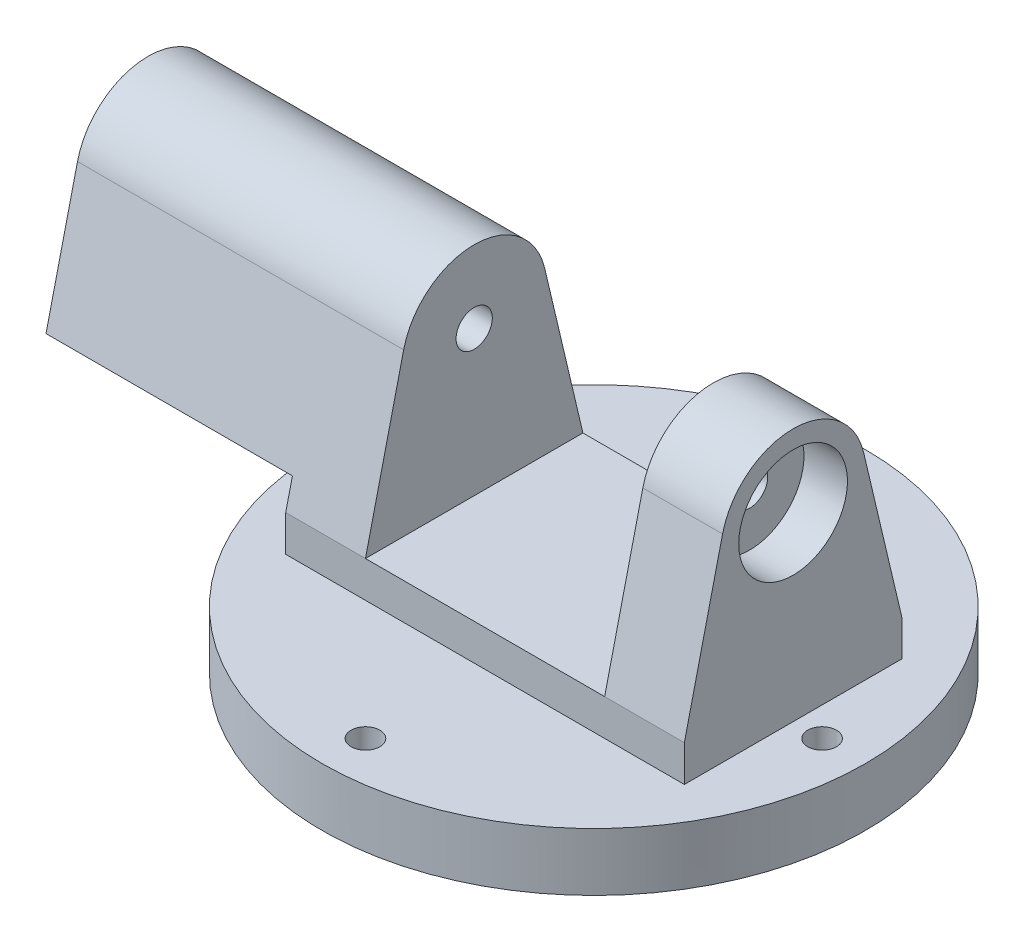
ISO-10303-21;
HEADER;
FILE_DESCRIPTION(('STEP AP214'),'2;1');
FILE_NAME('part.step','',(''),(''),'','','');
FILE_SCHEMA(('AUTOMOTIVE_DESIGN { 1 0 10303 214 1 1 1 1 }'));
ENDSEC;
DATA;
#1=APPLICATION_CONTEXT('core data for automotive mechanical design processes');
#2=APPLICATION_PROTOCOL_DEFINITION('international standard','automotive_design',2000,#1);
#3=PRODUCT_CONTEXT('',#1,'mechanical');
#4=PRODUCT('Part','Part','',(#3));
#5=PRODUCT_RELATED_PRODUCT_CATEGORY('part','',(#4));
#6=PRODUCT_DEFINITION_FORMATION('','',#4);
#7=PRODUCT_DEFINITION_CONTEXT('part definition',#1,'design');
#8=PRODUCT_DEFINITION('design','',#6,#7);
#9=PRODUCT_DEFINITION_SHAPE('','',#8);
#10=(LENGTH_UNIT() NAMED_UNIT(*) SI_UNIT(.MILLI.,.METRE.));
#11=(NAMED_UNIT(*) PLANE_ANGLE_UNIT() SI_UNIT($,.RADIAN.));
#12=(NAMED_UNIT(*) SI_UNIT($,.STERADIAN.) SOLID_ANGLE_UNIT());
#13=UNCERTAINTY_MEASURE_WITH_UNIT(LENGTH_MEASURE(1.E-05),#10,'distance_accuracy_value','');
#14=(GEOMETRIC_REPRESENTATION_CONTEXT(3) GLOBAL_UNCERTAINTY_ASSIGNED_CONTEXT((#13)) GLOBAL_UNIT_ASSIGNED_CONTEXT((#10,
#11,#12)) REPRESENTATION_CONTEXT('',''));
#15=CARTESIAN_POINT('',(0.,0.,0.));
#16=DIRECTION('',(0.,0.,1.));
#17=DIRECTION('',(1.,0.,0.));
#18=AXIS2_PLACEMENT_3D('',#15,#16,#17);
#19=CARTESIAN_POINT('',(-55.,18.,0.));
#20=DIRECTION('',(1.,0.,0.));
#21=DIRECTION('',(0.,0.,-1.));
#22=AXIS2_PLACEMENT_3D('',#19,#20,#21);
#23=PLANE('',#22);
#24=DIRECTION('',(0.,0.,1.));
#25=VECTOR('',#24,1.);
#26=CARTESIAN_POINT('',(-55.,25.8246682424095,-28.15152747619));
#27=LINE('',#26,#25);
#28=CARTESIAN_POINT('',(-55.,25.8246682424095,-28.15152747619));
#29=VERTEX_POINT('',#28);
#30=CARTESIAN_POINT('',(-55.,25.8246682424095,28.15152747619));
#31=VERTEX_POINT('',#30);
#32=EDGE_CURVE('E159',#29,#31,#27,.T.);
#33=ORIENTED_EDGE('',*,*,#32,.F.);
#34=DIRECTION('',(0.,0.973212295808088,0.229908301911762));
#35=VECTOR('',#34,1.);
#36=CARTESIAN_POINT('',(-55.,18.,-30.));
#37=LINE('',#36,#35);
#38=CARTESIAN_POINT('',(-55.,18.,-30.));
#39=VERTEX_POINT('',#38);
#40=EDGE_CURVE('E191',#39,#29,#37,.T.);
#41=ORIENTED_EDGE('',*,*,#40,.F.);
#42=DIRECTION('',(0.,-1.,0.));
#43=VECTOR('',#42,1.);
#44=CARTESIAN_POINT('',(-55.,18.,-30.));
#45=LINE('',#44,#43);
#46=CARTESIAN_POINT('',(-55.,8.,-30.));
#47=VERTEX_POINT('',#46);
#48=EDGE_CURVE('E240',#39,#47,#45,.T.);
#49=ORIENTED_EDGE('',*,*,#48,.T.);
#50=DIRECTION('',(0.,0.,1.));
#51=VECTOR('',#50,1.);
#52=CARTESIAN_POINT('',(-55.,8.,0.));
#53=LINE('',#52,#51);
#54=CARTESIAN_POINT('',(-55.,8.,30.));
#55=VERTEX_POINT('',#54);
#56=EDGE_CURVE('E247',#47,#55,#53,.T.);
#57=ORIENTED_EDGE('',*,*,#56,.T.);
#58=DIRECTION('',(0.,-1.,0.));
#59=VECTOR('',#58,1.);
#60=CARTESIAN_POINT('',(-55.,18.,30.));
#61=LINE('',#60,#59);
#62=CARTESIAN_POINT('',(-55.,18.,30.));
#63=VERTEX_POINT('',#62);
#64=EDGE_CURVE('E256',#63,#55,#61,.T.);
#65=ORIENTED_EDGE('',*,*,#64,.F.);
#66=DIRECTION('',(0.,-0.973212295808088,0.229908301911763));
#67=VECTOR('',#66,1.);
#68=CARTESIAN_POINT('',(-55.,18.,30.));
#69=LINE('',#68,#67);
#70=EDGE_CURVE('E194',#31,#63,#69,.T.);
#71=ORIENTED_EDGE('',*,*,#70,.F.);
#72=EDGE_LOOP('',(#33,#41,#49,#57,#65,#71));
#73=FACE_BOUND('',#72,.T.);
#74=ADVANCED_FACE('F42',(#73),#23,.F.);
#75=CARTESIAN_POINT('',(0.,18.,0.));
#76=DIRECTION('',(0.,-1.,0.));
#77=DIRECTION('',(0.,0.,-1.));
#78=AXIS2_PLACEMENT_3D('',#75,#76,#77);
#79=PLANE('',#78);
#80=DIRECTION('',(0.,0.,-1.));
#81=VECTOR('',#80,1.);
#82=CARTESIAN_POINT('',(-33.,18.,30.));
#83=LINE('',#82,#81);
#84=CARTESIAN_POINT('',(-33.,18.,30.));
#85=VERTEX_POINT('',#84);
#86=CARTESIAN_POINT('',(-33.,18.,-30.));
#87=VERTEX_POINT('',#86);
#88=EDGE_CURVE('E64',#85,#87,#83,.T.);
#89=ORIENTED_EDGE('',*,*,#88,.F.);
#90=DIRECTION('',(1.,0.,0.));
#91=VECTOR('',#90,1.);
#92=CARTESIAN_POINT('',(55.,18.,30.));
#93=LINE('',#92,#91);
#94=CARTESIAN_POINT('',(33.,18.,30.));
#95=VERTEX_POINT('',#94);
#96=EDGE_CURVE('E236',#85,#95,#93,.T.);
#97=ORIENTED_EDGE('',*,*,#96,.T.);
#98=DIRECTION('',(0.,0.,-1.));
#99=VECTOR('',#98,1.);
#100=CARTESIAN_POINT('',(33.,18.,30.));
#101=LINE('',#100,#99);
#102=CARTESIAN_POINT('',(33.,18.,-30.));
#103=VERTEX_POINT('',#102);
#104=EDGE_CURVE('E212',#95,#103,#101,.T.);
#105=ORIENTED_EDGE('',*,*,#104,.T.);
#106=DIRECTION('',(-1.,0.,0.));
#107=VECTOR('',#106,1.);
#108=CARTESIAN_POINT('',(-55.,18.,-30.));
#109=LINE('',#108,#107);
#110=EDGE_CURVE('E235',#103,#87,#109,.T.);
#111=ORIENTED_EDGE('',*,*,#110,.T.);
#112=EDGE_LOOP('',(#89,#97,#105,#111));
#113=FACE_BOUND('',#112,.T.);
#114=ADVANCED_FACE('F347',(#113),#79,.F.);
#115=CARTESIAN_POINT('',(0.,8.,0.));
#116=DIRECTION('',(0.,1.,0.));
#117=DIRECTION('',(0.,0.,1.));
#118=AXIS2_PLACEMENT_3D('',#115,#116,#117);
#119=PLANE('',#118);
#120=CARTESIAN_POINT('',(0.,8.,-63.));
#121=DIRECTION('',(0.,1.,0.));
#122=DIRECTION('',(0.,0.,1.));
#123=AXIS2_PLACEMENT_3D('',#120,#121,#122);
#124=CIRCLE('',#123,3.97);
#125=CARTESIAN_POINT('',(0.,8.,-59.03));
#126=VERTEX_POINT('',#125);
#127=EDGE_CURVE('E260',#126,#126,#124,.T.);
#128=ORIENTED_EDGE('',*,*,#127,.F.);
#129=EDGE_LOOP('',(#128));
#130=FACE_BOUND('',#129,.T.);
#131=CARTESIAN_POINT('',(63.,8.,2.21432900506094E-13));
#132=DIRECTION('',(0.,1.,0.));
#133=DIRECTION('',(0.,0.,1.));
#134=AXIS2_PLACEMENT_3D('',#131,#132,#133);
#135=CIRCLE('',#134,3.97);
#136=CARTESIAN_POINT('',(63.,8.,3.97000000000022));
#137=VERTEX_POINT('',#136);
#138=EDGE_CURVE('E264',#137,#137,#135,.T.);
#139=ORIENTED_EDGE('',*,*,#138,.F.);
#140=EDGE_LOOP('',(#139));
#141=FACE_BOUND('',#140,.T.);
#142=CARTESIAN_POINT('',(-4.41396224853212E-13,8.,63.));
#143=DIRECTION('',(0.,1.,0.));
#144=DIRECTION('',(0.,0.,1.));
#145=AXIS2_PLACEMENT_3D('',#142,#143,#144);
#146=CIRCLE('',#145,3.97);
#147=CARTESIAN_POINT('',(-4.41396224853212E-13,8.,66.97));
#148=VERTEX_POINT('',#147);
#149=EDGE_CURVE('E267',#148,#148,#146,.T.);
#150=ORIENTED_EDGE('',*,*,#149,.F.);
#151=EDGE_LOOP('',(#150));
#152=FACE_BOUND('',#151,.T.);
#153=CARTESIAN_POINT('',(-63.,8.,-6.61359549200329E-13));
#154=DIRECTION('',(0.,1.,0.));
#155=DIRECTION('',(0.,0.,1.));
#156=AXIS2_PLACEMENT_3D('',#153,#154,#155);
#157=CIRCLE('',#156,3.97);
#158=CARTESIAN_POINT('',(-63.,8.,3.96999999999934));
#159=VERTEX_POINT('',#158);
#160=EDGE_CURVE('E259',#159,#159,#157,.T.);
#161=ORIENTED_EDGE('',*,*,#160,.F.);
#162=EDGE_LOOP('',(#161));
#163=FACE_BOUND('',#162,.T.);
#164=CARTESIAN_POINT('',(0.,8.,0.));
#165=DIRECTION('',(0.,1.,0.));
#166=DIRECTION('',(0.,0.,1.));
#167=AXIS2_PLACEMENT_3D('',#164,#165,#166);
#168=CIRCLE('',#167,75.);
#169=CARTESIAN_POINT('',(0.,8.,75.));
#170=VERTEX_POINT('',#169);
#171=EDGE_CURVE('E50',#170,#170,#168,.T.);
#172=ORIENTED_EDGE('',*,*,#171,.T.);
#173=EDGE_LOOP('',(#172));
#174=FACE_BOUND('',#173,.T.);
#175=DIRECTION('',(0.,0.,-1.));
#176=VECTOR('',#175,1.);
#177=CARTESIAN_POINT('',(55.,8.,-30.));
#178=LINE('',#177,#176);
#179=CARTESIAN_POINT('',(55.,8.,30.));
#180=VERTEX_POINT('',#179);
#181=CARTESIAN_POINT('',(55.,8.,-30.));
#182=VERTEX_POINT('',#181);
#183=EDGE_CURVE('E242',#180,#182,#178,.T.);
#184=ORIENTED_EDGE('',*,*,#183,.F.);
#185=DIRECTION('',(1.,0.,0.));
#186=VECTOR('',#185,1.);
#187=CARTESIAN_POINT('',(55.,8.,30.));
#188=LINE('',#187,#186);
#189=EDGE_CURVE('E228',#55,#180,#188,.T.);
#190=ORIENTED_EDGE('',*,*,#189,.F.);
#191=ORIENTED_EDGE('',*,*,#56,.F.);
#192=DIRECTION('',(-1.,0.,0.));
#193=VECTOR('',#192,1.);
#194=CARTESIAN_POINT('',(-55.,8.,-30.));
#195=LINE('',#194,#193);
#196=EDGE_CURVE('E244',#182,#47,#195,.T.);
#197=ORIENTED_EDGE('',*,*,#196,.F.);
#198=EDGE_LOOP('',(#184,#190,#191,#197));
#199=FACE_BOUND('',#198,.T.);
#200=ADVANCED_FACE('F317',(#130,#141,#152,#163,#174,#199),#119,.T.);
#201=CARTESIAN_POINT('',(0.,8.,0.));
#202=DIRECTION('',(0.,-1.,0.));
#203=DIRECTION('',(0.,0.,-1.));
#204=AXIS2_PLACEMENT_3D('',#201,#202,#203);
#205=CYLINDRICAL_SURFACE('',#204,75.);
#206=ORIENTED_EDGE('',*,*,#171,.F.);
#207=EDGE_LOOP('',(#206));
#208=FACE_BOUND('',#207,.T.);
#209=CARTESIAN_POINT('',(0.,-8.,0.));
#210=DIRECTION('',(0.,-1.,0.));
#211=DIRECTION('',(0.,0.,-1.));
#212=AXIS2_PLACEMENT_3D('',#209,#210,#211);
#213=CIRCLE('',#212,75.);
#214=CARTESIAN_POINT('',(0.,-8.,-75.));
#215=VERTEX_POINT('',#214);
#216=EDGE_CURVE('E396',#215,#215,#213,.T.);
#217=ORIENTED_EDGE('',*,*,#216,.F.);
#218=EDGE_LOOP('',(#217));
#219=FACE_BOUND('',#218,.T.);
#220=ADVANCED_FACE('F44',(#208,#219),#205,.T.);
#221=CARTESIAN_POINT('',(-63.,-12.,-6.61359549200329E-13));
#222=DIRECTION('',(0.,1.,0.));
#223=DIRECTION('',(0.,0.,1.));
#224=AXIS2_PLACEMENT_3D('',#221,#222,#223);
#225=CYLINDRICAL_SURFACE('',#224,3.97);
#226=ORIENTED_EDGE('',*,*,#160,.T.);
#227=EDGE_LOOP('',(#226));
#228=FACE_BOUND('',#227,.T.);
#229=CARTESIAN_POINT('',(-63.,0.,-6.61359549200329E-13));
#230=DIRECTION('',(0.,1.,0.));
#231=DIRECTION('',(0.,0.,1.));
#232=AXIS2_PLACEMENT_3D('',#229,#230,#231);
#233=CIRCLE('',#232,3.97);
#234=CARTESIAN_POINT('',(-63.,0.,3.96999999999934));
#235=VERTEX_POINT('',#234);
#236=EDGE_CURVE('E263',#235,#235,#233,.T.);
#237=ORIENTED_EDGE('',*,*,#236,.F.);
#238=EDGE_LOOP('',(#237));
#239=FACE_BOUND('',#238,.T.);
#240=ADVANCED_FACE('F373',(#228,#239),#225,.F.);
#241=CARTESIAN_POINT('',(-4.41396224853212E-13,-12.,63.));
#242=DIRECTION('',(0.,1.,0.));
#243=DIRECTION('',(0.,0.,1.));
#244=AXIS2_PLACEMENT_3D('',#241,#242,#243);
#245=CYLINDRICAL_SURFACE('',#244,3.97);
#246=ORIENTED_EDGE('',*,*,#149,.T.);
#247=EDGE_LOOP('',(#246));
#248=FACE_BOUND('',#247,.T.);
#249=CARTESIAN_POINT('',(-4.41396224853212E-13,0.,63.));
#250=DIRECTION('',(0.,1.,0.));
#251=DIRECTION('',(0.,0.,1.));
#252=AXIS2_PLACEMENT_3D('',#249,#250,#251);
#253=CIRCLE('',#252,3.97);
#254=CARTESIAN_POINT('',(-4.41396224853212E-13,0.,66.97));
#255=VERTEX_POINT('',#254);
#256=EDGE_CURVE('E277',#255,#255,#253,.T.);
#257=ORIENTED_EDGE('',*,*,#256,.F.);
#258=EDGE_LOOP('',(#257));
#259=FACE_BOUND('',#258,.T.);
#260=ADVANCED_FACE('F369',(#248,#259),#245,.F.);
#261=CARTESIAN_POINT('',(63.,-12.,2.21432900506094E-13));
#262=DIRECTION('',(0.,1.,0.));
#263=DIRECTION('',(0.,0.,1.));
#264=AXIS2_PLACEMENT_3D('',#261,#262,#263);
#265=CYLINDRICAL_SURFACE('',#264,3.97);
#266=ORIENTED_EDGE('',*,*,#138,.T.);
#267=EDGE_LOOP('',(#266));
#268=FACE_BOUND('',#267,.T.);
#269=CARTESIAN_POINT('',(63.,0.,2.21432900506094E-13));
#270=DIRECTION('',(0.,1.,0.));
#271=DIRECTION('',(0.,0.,1.));
#272=AXIS2_PLACEMENT_3D('',#269,#270,#271);
#273=CIRCLE('',#272,3.97);
#274=CARTESIAN_POINT('',(63.,0.,3.97000000000022));
#275=VERTEX_POINT('',#274);
#276=EDGE_CURVE('E280',#275,#275,#273,.T.);
#277=ORIENTED_EDGE('',*,*,#276,.F.);
#278=EDGE_LOOP('',(#277));
#279=FACE_BOUND('',#278,.T.);
#280=ADVANCED_FACE('F365',(#268,#279),#265,.F.);
#281=CARTESIAN_POINT('',(0.,-12.,-63.));
#282=DIRECTION('',(0.,1.,0.));
#283=DIRECTION('',(0.,0.,1.));
#284=AXIS2_PLACEMENT_3D('',#281,#282,#283);
#285=CYLINDRICAL_SURFACE('',#284,3.97);
#286=ORIENTED_EDGE('',*,*,#127,.T.);
#287=EDGE_LOOP('',(#286));
#288=FACE_BOUND('',#287,.T.);
#289=CARTESIAN_POINT('',(0.,0.,-63.));
#290=DIRECTION('',(0.,1.,0.));
#291=DIRECTION('',(0.,0.,1.));
#292=AXIS2_PLACEMENT_3D('',#289,#290,#291);
#293=CIRCLE('',#292,3.97);
#294=CARTESIAN_POINT('',(0.,0.,-59.03));
#295=VERTEX_POINT('',#294);
#296=EDGE_CURVE('E274',#295,#295,#293,.T.);
#297=ORIENTED_EDGE('',*,*,#296,.F.);
#298=EDGE_LOOP('',(#297));
#299=FACE_BOUND('',#298,.T.);
#300=ADVANCED_FACE('F362',(#288,#299),#285,.F.);
#301=CARTESIAN_POINT('',(55.,18.,30.));
#302=DIRECTION('',(0.,0.,-1.));
#303=DIRECTION('',(-1.,0.,0.));
#304=AXIS2_PLACEMENT_3D('',#301,#302,#303);
#305=PLANE('',#304);
#306=ORIENTED_EDGE('',*,*,#189,.T.);
#307=DIRECTION('',(0.,-1.,0.));
#308=VECTOR('',#307,1.);
#309=CARTESIAN_POINT('',(55.,18.,30.));
#310=LINE('',#309,#308);
#311=CARTESIAN_POINT('',(55.,18.,30.));
#312=VERTEX_POINT('',#311);
#313=EDGE_CURVE('E253',#312,#180,#310,.T.);
#314=ORIENTED_EDGE('',*,*,#313,.F.);
#315=DIRECTION('',(1.,0.,0.));
#316=VECTOR('',#315,1.);
#317=CARTESIAN_POINT('',(33.,18.,30.));
#318=LINE('',#317,#316);
#319=EDGE_CURVE('E229',#95,#312,#318,.T.);
#320=ORIENTED_EDGE('',*,*,#319,.F.);
#321=ORIENTED_EDGE('',*,*,#96,.F.);
#322=EDGE_CURVE('E232',#63,#85,#93,.T.);
#323=ORIENTED_EDGE('',*,*,#322,.F.);
#324=ORIENTED_EDGE('',*,*,#64,.T.);
#325=EDGE_LOOP('',(#306,#314,#320,#321,#323,#324));
#326=FACE_BOUND('',#325,.T.);
#327=ADVANCED_FACE('F307',(#326),#305,.F.);
#328=CARTESIAN_POINT('',(55.,18.,-30.));
#329=DIRECTION('',(-1.,0.,0.));
#330=DIRECTION('',(0.,0.,1.));
#331=AXIS2_PLACEMENT_3D('',#328,#329,#330);
#332=PLANE('',#331);
#333=CARTESIAN_POINT('',(55.,58.,0.));
#334=DIRECTION('',(-1.,0.,0.));
#335=DIRECTION('',(0.,0.,1.));
#336=AXIS2_PLACEMENT_3D('',#333,#334,#335);
#337=CIRCLE('',#336,15.);
#338=CARTESIAN_POINT('',(55.,58.,15.));
#339=VERTEX_POINT('',#338);
#340=EDGE_CURVE('E182',#339,#339,#337,.T.);
#341=ORIENTED_EDGE('',*,*,#340,.T.);
#342=EDGE_LOOP('',(#341));
#343=FACE_BOUND('',#342,.T.);
#344=ORIENTED_EDGE('',*,*,#183,.T.);
#345=DIRECTION('',(0.,-1.,0.));
#346=VECTOR('',#345,1.);
#347=CARTESIAN_POINT('',(55.,18.,-30.));
#348=LINE('',#347,#346);
#349=CARTESIAN_POINT('',(55.,18.,-30.));
#350=VERTEX_POINT('',#349);
#351=EDGE_CURVE('E250',#350,#182,#348,.T.);
#352=ORIENTED_EDGE('',*,*,#351,.F.);
#353=DIRECTION('',(0.,0.973212295808088,0.229908301911762));
#354=VECTOR('',#353,1.);
#355=CARTESIAN_POINT('',(55.,18.,-30.));
#356=LINE('',#355,#354);
#357=CARTESIAN_POINT('',(55.,62.5981744983486,-19.4642817282061));
#358=VERTEX_POINT('',#357);
#359=EDGE_CURVE('E209',#350,#358,#356,.T.);
#360=ORIENTED_EDGE('',*,*,#359,.T.);
#361=CARTESIAN_POINT('',(55.,58.,0.));
#362=DIRECTION('',(1.,0.,0.));
#363=DIRECTION('',(0.,0.,-1.));
#364=AXIS2_PLACEMENT_3D('',#361,#362,#363);
#365=CIRCLE('',#364,20.0000367977721);
#366=CARTESIAN_POINT('',(55.,62.5981744983486,19.4642817282061));
#367=VERTEX_POINT('',#366);
#368=EDGE_CURVE('E203',#358,#367,#365,.T.);
#369=ORIENTED_EDGE('',*,*,#368,.T.);
#370=DIRECTION('',(0.,-0.973212295808088,0.229908301911763));
#371=VECTOR('',#370,1.);
#372=CARTESIAN_POINT('',(55.,18.,30.));
#373=LINE('',#372,#371);
#374=EDGE_CURVE('E221',#367,#312,#373,.T.);
#375=ORIENTED_EDGE('',*,*,#374,.T.);
#376=ORIENTED_EDGE('',*,*,#313,.T.);
#377=EDGE_LOOP('',(#344,#352,#360,#369,#375,#376));
#378=FACE_BOUND('',#377,.T.);
#379=ADVANCED_FACE('F303',(#343,#378),#332,.F.);
#380=CARTESIAN_POINT('',(-55.,18.,-30.));
#381=DIRECTION('',(0.,0.,1.));
#382=DIRECTION('',(1.,0.,0.));
#383=AXIS2_PLACEMENT_3D('',#380,#381,#382);
#384=PLANE('',#383);
#385=ORIENTED_EDGE('',*,*,#196,.T.);
#386=ORIENTED_EDGE('',*,*,#48,.F.);
#387=DIRECTION('',(-1.,0.,0.));
#388=VECTOR('',#387,1.);
#389=CARTESIAN_POINT('',(-33.,18.,-30.));
#390=LINE('',#389,#388);
#391=EDGE_CURVE('E57',#87,#39,#390,.T.);
#392=ORIENTED_EDGE('',*,*,#391,.F.);
#393=ORIENTED_EDGE('',*,*,#110,.F.);
#394=EDGE_CURVE('E237',#350,#103,#109,.T.);
#395=ORIENTED_EDGE('',*,*,#394,.F.);
#396=ORIENTED_EDGE('',*,*,#351,.T.);
#397=EDGE_LOOP('',(#385,#386,#392,#393,#395,#396));
#398=FACE_BOUND('',#397,.T.);
#399=ADVANCED_FACE('F306',(#398),#384,.F.);
#400=CARTESIAN_POINT('',(33.,58.,0.));
#401=DIRECTION('',(1.,0.,0.));
#402=DIRECTION('',(0.,0.,-1.));
#403=AXIS2_PLACEMENT_3D('',#400,#401,#402);
#404=CYLINDRICAL_SURFACE('',#403,20.0000367977721);
#405=ORIENTED_EDGE('',*,*,#368,.F.);
#406=DIRECTION('',(1.,0.,0.));
#407=VECTOR('',#406,1.);
#408=CARTESIAN_POINT('',(33.,62.5981744983486,-19.4642817282061));
#409=LINE('',#408,#407);
#410=CARTESIAN_POINT('',(33.,62.5981744983486,-19.4642817282061));
#411=VERTEX_POINT('',#410);
#412=EDGE_CURVE('E226',#411,#358,#409,.T.);
#413=ORIENTED_EDGE('',*,*,#412,.F.);
#414=CARTESIAN_POINT('',(33.,58.,0.));
#415=DIRECTION('',(1.,0.,0.));
#416=DIRECTION('',(0.,0.,-1.));
#417=AXIS2_PLACEMENT_3D('',#414,#415,#416);
#418=CIRCLE('',#417,20.0000367977721);
#419=CARTESIAN_POINT('',(33.,62.5981744983486,19.4642817282061));
#420=VERTEX_POINT('',#419);
#421=EDGE_CURVE('E205',#411,#420,#418,.T.);
#422=ORIENTED_EDGE('',*,*,#421,.T.);
#423=DIRECTION('',(1.,0.,0.));
#424=VECTOR('',#423,1.);
#425=CARTESIAN_POINT('',(33.,62.5981744983486,19.4642817282061));
#426=LINE('',#425,#424);
#427=EDGE_CURVE('E218',#420,#367,#426,.T.);
#428=ORIENTED_EDGE('',*,*,#427,.T.);
#429=EDGE_LOOP('',(#405,#413,#422,#428));
#430=FACE_BOUND('',#429,.T.);
#431=ADVANCED_FACE('F358',(#430),#404,.T.);
#432=CARTESIAN_POINT('',(33.,18.,-30.));
#433=DIRECTION('',(0.,0.229908301911762,-0.973212295808088));
#434=DIRECTION('',(0.,0.973212295808088,0.229908301911762));
#435=AXIS2_PLACEMENT_3D('',#432,#433,#434);
#436=PLANE('',#435);
#437=ORIENTED_EDGE('',*,*,#359,.F.);
#438=ORIENTED_EDGE('',*,*,#394,.T.);
#439=DIRECTION('',(0.,0.973212295808088,0.229908301911762));
#440=VECTOR('',#439,1.);
#441=CARTESIAN_POINT('',(33.,18.,-30.));
#442=LINE('',#441,#440);
#443=EDGE_CURVE('E215',#103,#411,#442,.T.);
#444=ORIENTED_EDGE('',*,*,#443,.T.);
#445=ORIENTED_EDGE('',*,*,#412,.T.);
#446=EDGE_LOOP('',(#437,#438,#444,#445));
#447=FACE_BOUND('',#446,.T.);
#448=ADVANCED_FACE('F543',(#447),#436,.T.);
#449=CARTESIAN_POINT('',(33.,18.,30.));
#450=DIRECTION('',(0.,0.229908301911763,0.973212295808088));
#451=DIRECTION('',(0.,-0.973212295808088,0.229908301911763));
#452=AXIS2_PLACEMENT_3D('',#449,#450,#451);
#453=PLANE('',#452);
#454=ORIENTED_EDGE('',*,*,#374,.F.);
#455=ORIENTED_EDGE('',*,*,#427,.F.);
#456=DIRECTION('',(0.,-0.973212295808088,0.229908301911763));
#457=VECTOR('',#456,1.);
#458=CARTESIAN_POINT('',(33.,18.,30.));
#459=LINE('',#458,#457);
#460=EDGE_CURVE('E208',#420,#95,#459,.T.);
#461=ORIENTED_EDGE('',*,*,#460,.T.);
#462=ORIENTED_EDGE('',*,*,#319,.T.);
#463=EDGE_LOOP('',(#454,#455,#461,#462));
#464=FACE_BOUND('',#463,.T.);
#465=ADVANCED_FACE('F533',(#464),#453,.T.);
#466=CARTESIAN_POINT('',(33.,58.,0.));
#467=DIRECTION('',(1.,0.,0.));
#468=DIRECTION('',(0.,0.,-1.));
#469=AXIS2_PLACEMENT_3D('',#466,#467,#468);
#470=PLANE('',#469);
#471=CARTESIAN_POINT('',(33.,58.,0.));
#472=DIRECTION('',(1.,0.,0.));
#473=DIRECTION('',(0.,0.,-1.));
#474=AXIS2_PLACEMENT_3D('',#471,#472,#473);
#475=CIRCLE('',#474,5.);
#476=CARTESIAN_POINT('',(33.,58.,-5.));
#477=VERTEX_POINT('',#476);
#478=EDGE_CURVE('E179',#477,#477,#475,.T.);
#479=ORIENTED_EDGE('',*,*,#478,.T.);
#480=EDGE_LOOP('',(#479));
#481=FACE_BOUND('',#480,.T.);
#482=ORIENTED_EDGE('',*,*,#421,.F.);
#483=ORIENTED_EDGE('',*,*,#443,.F.);
#484=ORIENTED_EDGE('',*,*,#104,.F.);
#485=ORIENTED_EDGE('',*,*,#460,.F.);
#486=EDGE_LOOP('',(#482,#483,#484,#485));
#487=FACE_BOUND('',#486,.T.);
#488=ADVANCED_FACE('F518',(#481,#487),#470,.F.);
#489=CARTESIAN_POINT('',(-33.,58.,0.));
#490=DIRECTION('',(-1.,0.,0.));
#491=DIRECTION('',(0.,0.,1.));
#492=AXIS2_PLACEMENT_3D('',#489,#490,#491);
#493=CYLINDRICAL_SURFACE('',#492,20.0000367977721);
#494=DIRECTION('',(-1.,0.,0.));
#495=VECTOR('',#494,1.);
#496=CARTESIAN_POINT('',(-33.,62.5981744983486,-19.4642817282061));
#497=LINE('',#496,#495);
#498=CARTESIAN_POINT('',(-33.,62.5981744983486,-19.4642817282061));
#499=VERTEX_POINT('',#498);
#500=CARTESIAN_POINT('',(-123.,62.5981744983486,-19.4642817282061));
#501=VERTEX_POINT('',#500);
#502=EDGE_CURVE('E133',#499,#501,#497,.T.);
#503=ORIENTED_EDGE('',*,*,#502,.T.);
#504=CARTESIAN_POINT('',(-123.,58.0000000000001,-3.53883589099269E-13));
#505=DIRECTION('',(-1.,0.,0.));
#506=DIRECTION('',(0.,0.,1.));
#507=AXIS2_PLACEMENT_3D('',#504,#505,#506);
#508=CIRCLE('',#507,20.0000367977721);
#509=CARTESIAN_POINT('',(-123.,62.5981744983486,19.4642817282061));
#510=VERTEX_POINT('',#509);
#511=EDGE_CURVE('E138',#510,#501,#508,.T.);
#512=ORIENTED_EDGE('',*,*,#511,.F.);
#513=DIRECTION('',(-1.,0.,0.));
#514=VECTOR('',#513,1.);
#515=CARTESIAN_POINT('',(-33.,62.5981744983486,19.4642817282061));
#516=LINE('',#515,#514);
#517=CARTESIAN_POINT('',(-33.,62.5981744983486,19.4642817282061));
#518=VERTEX_POINT('',#517);
#519=EDGE_CURVE('E201',#518,#510,#516,.T.);
#520=ORIENTED_EDGE('',*,*,#519,.F.);
#521=CARTESIAN_POINT('',(-33.,58.,0.));
#522=DIRECTION('',(1.,0.,0.));
#523=DIRECTION('',(0.,0.,-1.));
#524=AXIS2_PLACEMENT_3D('',#521,#522,#523);
#525=CIRCLE('',#524,20.0000367977721);
#526=EDGE_CURVE('E140',#499,#518,#525,.T.);
#527=ORIENTED_EDGE('',*,*,#526,.F.);
#528=EDGE_LOOP('',(#503,#512,#520,#527));
#529=FACE_BOUND('',#528,.T.);
#530=ADVANCED_FACE('F135',(#529),#493,.T.);
#531=CARTESIAN_POINT('',(-33.,18.,30.));
#532=DIRECTION('',(0.,-0.229908301911763,-0.973212295808088));
#533=DIRECTION('',(0.,0.973212295808088,-0.229908301911763));
#534=AXIS2_PLACEMENT_3D('',#531,#532,#533);
#535=PLANE('',#534);
#536=ORIENTED_EDGE('',*,*,#519,.T.);
#537=DIRECTION('',(0.,0.973212295808088,-0.229908301911762));
#538=VECTOR('',#537,1.);
#539=CARTESIAN_POINT('',(-123.,25.8246682424095,28.15152747619));
#540=LINE('',#539,#538);
#541=CARTESIAN_POINT('',(-123.,25.8246682424095,28.15152747619));
#542=VERTEX_POINT('',#541);
#543=EDGE_CURVE('E158',#542,#510,#540,.T.);
#544=ORIENTED_EDGE('',*,*,#543,.F.);
#545=DIRECTION('',(1.,0.,0.));
#546=VECTOR('',#545,1.);
#547=CARTESIAN_POINT('',(-123.,25.8246682424095,28.15152747619));
#548=LINE('',#547,#546);
#549=EDGE_CURVE('E167',#542,#31,#548,.T.);
#550=ORIENTED_EDGE('',*,*,#549,.T.);
#551=ORIENTED_EDGE('',*,*,#70,.T.);
#552=ORIENTED_EDGE('',*,*,#322,.T.);
#553=DIRECTION('',(0.,-0.973212295808088,0.229908301911763));
#554=VECTOR('',#553,1.);
#555=CARTESIAN_POINT('',(-33.,18.,30.));
#556=LINE('',#555,#554);
#557=EDGE_CURVE('E143',#518,#85,#556,.T.);
#558=ORIENTED_EDGE('',*,*,#557,.F.);
#559=EDGE_LOOP('',(#536,#544,#550,#551,#552,#558));
#560=FACE_BOUND('',#559,.T.);
#561=ADVANCED_FACE('F327',(#560),#535,.F.);
#562=CARTESIAN_POINT('',(-33.,18.,-30.));
#563=DIRECTION('',(0.,-0.229908301911762,0.973212295808088));
#564=DIRECTION('',(0.,-0.973212295808088,-0.229908301911762));
#565=AXIS2_PLACEMENT_3D('',#562,#563,#564);
#566=PLANE('',#565);
#567=ORIENTED_EDGE('',*,*,#40,.T.);
#568=DIRECTION('',(1.,0.,0.));
#569=VECTOR('',#568,1.);
#570=CARTESIAN_POINT('',(-123.,25.8246682424095,-28.15152747619));
#571=LINE('',#570,#569);
#572=CARTESIAN_POINT('',(-123.,25.8246682424095,-28.15152747619));
#573=VERTEX_POINT('',#572);
#574=EDGE_CURVE('E149',#573,#29,#571,.T.);
#575=ORIENTED_EDGE('',*,*,#574,.F.);
#576=DIRECTION('',(0.,-0.973212295808088,-0.229908301911763));
#577=VECTOR('',#576,1.);
#578=CARTESIAN_POINT('',(-123.,62.5981744983486,-19.4642817282061));
#579=LINE('',#578,#577);
#580=EDGE_CURVE('E146',#501,#573,#579,.T.);
#581=ORIENTED_EDGE('',*,*,#580,.F.);
#582=ORIENTED_EDGE('',*,*,#502,.F.);
#583=DIRECTION('',(0.,0.973212295808088,0.229908301911762));
#584=VECTOR('',#583,1.);
#585=CARTESIAN_POINT('',(-33.,18.,-30.));
#586=LINE('',#585,#584);
#587=EDGE_CURVE('E193',#87,#499,#586,.T.);
#588=ORIENTED_EDGE('',*,*,#587,.F.);
#589=ORIENTED_EDGE('',*,*,#391,.T.);
#590=EDGE_LOOP('',(#567,#575,#581,#582,#588,#589));
#591=FACE_BOUND('',#590,.T.);
#592=ADVANCED_FACE('F148',(#591),#566,.F.);
#593=CARTESIAN_POINT('',(-33.,58.,0.));
#594=DIRECTION('',(-1.,0.,0.));
#595=DIRECTION('',(0.,0.,-1.));
#596=AXIS2_PLACEMENT_3D('',#593,#594,#595);
#597=PLANE('',#596);
#598=CARTESIAN_POINT('',(-33.,58.,0.));
#599=DIRECTION('',(-1.,0.,0.));
#600=DIRECTION('',(0.,0.,1.));
#601=AXIS2_PLACEMENT_3D('',#598,#599,#600);
#602=CIRCLE('',#601,5.);
#603=CARTESIAN_POINT('',(-33.,58.,5.));
#604=VERTEX_POINT('',#603);
#605=EDGE_CURVE('E176',#604,#604,#602,.T.);
#606=ORIENTED_EDGE('',*,*,#605,.T.);
#607=EDGE_LOOP('',(#606));
#608=FACE_BOUND('',#607,.T.);
#609=ORIENTED_EDGE('',*,*,#526,.T.);
#610=ORIENTED_EDGE('',*,*,#557,.T.);
#611=ORIENTED_EDGE('',*,*,#88,.T.);
#612=ORIENTED_EDGE('',*,*,#587,.T.);
#613=EDGE_LOOP('',(#609,#610,#611,#612));
#614=FACE_BOUND('',#613,.T.);
#615=ADVANCED_FACE('F331',(#608,#614),#597,.F.);
#616=CARTESIAN_POINT('',(-43.,58.,0.));
#617=DIRECTION('',(-1.,0.,0.));
#618=DIRECTION('',(0.,0.,1.));
#619=AXIS2_PLACEMENT_3D('',#616,#617,#618);
#620=CYLINDRICAL_SURFACE('',#619,15.);
#621=CARTESIAN_POINT('',(-43.,58.,0.));
#622=DIRECTION('',(-1.,0.,0.));
#623=DIRECTION('',(0.,0.,1.));
#624=AXIS2_PLACEMENT_3D('',#621,#622,#623);
#625=CIRCLE('',#624,15.);
#626=CARTESIAN_POINT('',(-43.,58.,15.));
#627=VERTEX_POINT('',#626);
#628=EDGE_CURVE('E186',#627,#627,#625,.T.);
#629=ORIENTED_EDGE('',*,*,#628,.F.);
#630=EDGE_LOOP('',(#629));
#631=FACE_BOUND('',#630,.T.);
#632=CARTESIAN_POINT('',(-123.,58.0000000000001,-3.53883589099269E-13));
#633=DIRECTION('',(-1.,0.,0.));
#634=DIRECTION('',(0.,0.,1.));
#635=AXIS2_PLACEMENT_3D('',#632,#633,#634);
#636=CIRCLE('',#635,15.0000000000003);
#637=CARTESIAN_POINT('',(-123.,58.0000000000001,15.));
#638=VERTEX_POINT('',#637);
#639=EDGE_CURVE('E161',#638,#638,#636,.T.);
#640=ORIENTED_EDGE('',*,*,#639,.T.);
#641=EDGE_LOOP('',(#640));
#642=FACE_BOUND('',#641,.T.);
#643=ADVANCED_FACE('F333',(#631,#642),#620,.F.);
#644=CARTESIAN_POINT('',(-43.,58.,0.));
#645=DIRECTION('',(-1.,0.,0.));
#646=DIRECTION('',(0.,0.,1.));
#647=AXIS2_PLACEMENT_3D('',#644,#645,#646);
#648=PLANE('',#647);
#649=CARTESIAN_POINT('',(-43.,58.,0.));
#650=DIRECTION('',(-1.,0.,0.));
#651=DIRECTION('',(0.,0.,1.));
#652=AXIS2_PLACEMENT_3D('',#649,#650,#651);
#653=CIRCLE('',#652,5.);
#654=CARTESIAN_POINT('',(-43.,58.,5.));
#655=VERTEX_POINT('',#654);
#656=EDGE_CURVE('E172',#655,#655,#653,.T.);
#657=ORIENTED_EDGE('',*,*,#656,.F.);
#658=EDGE_LOOP('',(#657));
#659=FACE_BOUND('',#658,.T.);
#660=ORIENTED_EDGE('',*,*,#628,.T.);
#661=EDGE_LOOP('',(#660));
#662=FACE_BOUND('',#661,.T.);
#663=ADVANCED_FACE('F299',(#659,#662),#648,.T.);
#664=CARTESIAN_POINT('',(43.,58.,0.));
#665=DIRECTION('',(1.,0.,0.));
#666=DIRECTION('',(0.,0.,-1.));
#667=AXIS2_PLACEMENT_3D('',#664,#665,#666);
#668=CYLINDRICAL_SURFACE('',#667,15.);
#669=CARTESIAN_POINT('',(43.,58.,0.));
#670=DIRECTION('',(-1.,0.,0.));
#671=DIRECTION('',(0.,0.,1.));
#672=AXIS2_PLACEMENT_3D('',#669,#670,#671);
#673=CIRCLE('',#672,15.);
#674=CARTESIAN_POINT('',(43.,58.,15.));
#675=VERTEX_POINT('',#674);
#676=EDGE_CURVE('E183',#675,#675,#673,.T.);
#677=ORIENTED_EDGE('',*,*,#676,.T.);
#678=EDGE_LOOP('',(#677));
#679=FACE_BOUND('',#678,.T.);
#680=ORIENTED_EDGE('',*,*,#340,.F.);
#681=EDGE_LOOP('',(#680));
#682=FACE_BOUND('',#681,.T.);
#683=ADVANCED_FACE('F293',(#679,#682),#668,.F.);
#684=CARTESIAN_POINT('',(43.,58.,0.));
#685=DIRECTION('',(1.,0.,0.));
#686=DIRECTION('',(0.,0.,1.));
#687=AXIS2_PLACEMENT_3D('',#684,#685,#686);
#688=PLANE('',#687);
#689=CARTESIAN_POINT('',(43.,58.,0.));
#690=DIRECTION('',(1.,0.,0.));
#691=DIRECTION('',(0.,0.,-1.));
#692=AXIS2_PLACEMENT_3D('',#689,#690,#691);
#693=CIRCLE('',#692,5.);
#694=CARTESIAN_POINT('',(43.,58.,-5.));
#695=VERTEX_POINT('',#694);
#696=EDGE_CURVE('E175',#695,#695,#693,.T.);
#697=ORIENTED_EDGE('',*,*,#696,.F.);
#698=EDGE_LOOP('',(#697));
#699=FACE_BOUND('',#698,.T.);
#700=ORIENTED_EDGE('',*,*,#676,.F.);
#701=EDGE_LOOP('',(#700));
#702=FACE_BOUND('',#701,.T.);
#703=ADVANCED_FACE('F290',(#699,#702),#688,.T.);
#704=CARTESIAN_POINT('',(83.,58.,0.));
#705=DIRECTION('',(-1.,0.,0.));
#706=DIRECTION('',(0.,0.,1.));
#707=AXIS2_PLACEMENT_3D('',#704,#705,#706);
#708=CYLINDRICAL_SURFACE('',#707,5.);
#709=ORIENTED_EDGE('',*,*,#696,.T.);
#710=EDGE_LOOP('',(#709));
#711=FACE_BOUND('',#710,.T.);
#712=ORIENTED_EDGE('',*,*,#478,.F.);
#713=EDGE_LOOP('',(#712));
#714=FACE_BOUND('',#713,.T.);
#715=ADVANCED_FACE('F287',(#711,#714),#708,.F.);
#716=ORIENTED_EDGE('',*,*,#656,.T.);
#717=EDGE_LOOP('',(#716));
#718=FACE_BOUND('',#717,.T.);
#719=ORIENTED_EDGE('',*,*,#605,.F.);
#720=EDGE_LOOP('',(#719));
#721=FACE_BOUND('',#720,.T.);
#722=ADVANCED_FACE('F439',(#718,#721),#708,.F.);
#723=CARTESIAN_POINT('',(-123.,58.0000000000001,-3.53883589099269E-13));
#724=DIRECTION('',(-1.,0.,0.));
#725=DIRECTION('',(0.,0.,1.));
#726=AXIS2_PLACEMENT_3D('',#723,#724,#725);
#727=PLANE('',#726);
#728=ORIENTED_EDGE('',*,*,#511,.T.);
#729=ORIENTED_EDGE('',*,*,#580,.T.);
#730=DIRECTION('',(0.,0.,1.));
#731=VECTOR('',#730,1.);
#732=CARTESIAN_POINT('',(-123.,25.8246682424095,-28.15152747619));
#733=LINE('',#732,#731);
#734=EDGE_CURVE('E152',#573,#542,#733,.T.);
#735=ORIENTED_EDGE('',*,*,#734,.T.);
#736=ORIENTED_EDGE('',*,*,#543,.T.);
#737=EDGE_LOOP('',(#728,#729,#735,#736));
#738=FACE_BOUND('',#737,.T.);
#739=ORIENTED_EDGE('',*,*,#639,.F.);
#740=EDGE_LOOP('',(#739));
#741=FACE_BOUND('',#740,.T.);
#742=ADVANCED_FACE('F155',(#738,#741),#727,.T.);
#743=CARTESIAN_POINT('',(-123.,25.8246682424095,-28.15152747619));
#744=DIRECTION('',(0.,1.,0.));
#745=DIRECTION('',(0.,0.,1.));
#746=AXIS2_PLACEMENT_3D('',#743,#744,#745);
#747=PLANE('',#746);
#748=ORIENTED_EDGE('',*,*,#32,.T.);
#749=ORIENTED_EDGE('',*,*,#549,.F.);
#750=ORIENTED_EDGE('',*,*,#734,.F.);
#751=ORIENTED_EDGE('',*,*,#574,.T.);
#752=EDGE_LOOP('',(#748,#749,#750,#751));
#753=FACE_BOUND('',#752,.T.);
#754=ADVANCED_FACE('F438',(#753),#747,.F.);
#755=CARTESIAN_POINT('',(0.,0.,0.));
#756=DIRECTION('',(0.,-1.,0.));
#757=DIRECTION('',(0.,0.,-1.));
#758=AXIS2_PLACEMENT_3D('',#755,#756,#757);
#759=PLANE('',#758);
#760=ORIENTED_EDGE('',*,*,#236,.T.);
#761=EDGE_LOOP('',(#760));
#762=FACE_BOUND('',#761,.T.);
#763=ADVANCED_FACE('F435',(#762),#759,.F.);
#764=ORIENTED_EDGE('',*,*,#256,.T.);
#765=EDGE_LOOP('',(#764));
#766=FACE_BOUND('',#765,.T.);
#767=ADVANCED_FACE('F635',(#766),#759,.F.);
#768=ORIENTED_EDGE('',*,*,#276,.T.);
#769=EDGE_LOOP('',(#768));
#770=FACE_BOUND('',#769,.T.);
#771=ADVANCED_FACE('F433',(#770),#759,.F.);
#772=ORIENTED_EDGE('',*,*,#296,.T.);
#773=EDGE_LOOP('',(#772));
#774=FACE_BOUND('',#773,.T.);
#775=ADVANCED_FACE('F425',(#774),#759,.F.);
#776=CARTESIAN_POINT('',(0.,-8.,0.));
#777=DIRECTION('',(0.,-1.,0.));
#778=DIRECTION('',(0.,0.,-1.));
#779=AXIS2_PLACEMENT_3D('',#776,#777,#778);
#780=PLANE('',#779);
#781=CARTESIAN_POINT('',(0.,-8.,0.));
#782=DIRECTION('',(0.,-1.,0.));
#783=DIRECTION('',(0.,0.,-1.));
#784=AXIS2_PLACEMENT_3D('',#781,#782,#783);
#785=CIRCLE('',#784,15.);
#786=CARTESIAN_POINT('',(0.,-8.,-15.));
#787=VERTEX_POINT('',#786);
#788=EDGE_CURVE('E401',#787,#787,#785,.T.);
#789=ORIENTED_EDGE('',*,*,#788,.F.);
#790=EDGE_LOOP('',(#789));
#791=FACE_BOUND('',#790,.T.);
#792=ORIENTED_EDGE('',*,*,#216,.T.);
#793=EDGE_LOOP('',(#792));
#794=FACE_BOUND('',#793,.T.);
#795=ADVANCED_FACE('F416',(#791,#794),#780,.T.);
#796=CARTESIAN_POINT('',(0.,-26.,0.));
#797=DIRECTION('',(0.,-1.,0.));
#798=DIRECTION('',(0.,0.,-1.));
#799=AXIS2_PLACEMENT_3D('',#796,#797,#798);
#800=PLANE('',#799);
#801=CARTESIAN_POINT('',(0.,-26.,0.));
#802=DIRECTION('',(0.,-1.,0.));
#803=DIRECTION('',(0.,0.,-1.));
#804=AXIS2_PLACEMENT_3D('',#801,#802,#803);
#805=CIRCLE('',#804,15.);
#806=CARTESIAN_POINT('',(0.,-26.,-15.));
#807=VERTEX_POINT('',#806);
#808=EDGE_CURVE('E398',#807,#807,#805,.T.);
#809=ORIENTED_EDGE('',*,*,#808,.T.);
#810=EDGE_LOOP('',(#809));
#811=FACE_BOUND('',#810,.T.);
#812=CARTESIAN_POINT('',(0.,-26.,0.));
#813=DIRECTION('',(0.,-1.,0.));
#814=DIRECTION('',(0.,0.,-1.));
#815=AXIS2_PLACEMENT_3D('',#812,#813,#814);
#816=CIRCLE('',#815,13.);
#817=CARTESIAN_POINT('',(0.,-26.,-13.));
#818=VERTEX_POINT('',#817);
#819=EDGE_CURVE('E405',#818,#818,#816,.T.);
#820=ORIENTED_EDGE('',*,*,#819,.F.);
#821=EDGE_LOOP('',(#820));
#822=FACE_BOUND('',#821,.T.);
#823=ADVANCED_FACE('F413',(#811,#822),#800,.T.);
#824=CARTESIAN_POINT('',(0.,-26.,0.));
#825=DIRECTION('',(0.,1.,0.));
#826=DIRECTION('',(0.,0.,1.));
#827=AXIS2_PLACEMENT_3D('',#824,#825,#826);
#828=CYLINDRICAL_SURFACE('',#827,15.);
#829=ORIENTED_EDGE('',*,*,#808,.F.);
#830=EDGE_LOOP('',(#829));
#831=FACE_BOUND('',#830,.T.);
#832=ORIENTED_EDGE('',*,*,#788,.T.);
#833=EDGE_LOOP('',(#832));
#834=FACE_BOUND('',#833,.T.);
#835=ADVANCED_FACE('F415',(#831,#834),#828,.T.);
#836=CARTESIAN_POINT('',(0.,-26.,0.));
#837=DIRECTION('',(0.,1.,0.));
#838=DIRECTION('',(0.,0.,1.));
#839=AXIS2_PLACEMENT_3D('',#836,#837,#838);
#840=CYLINDRICAL_SURFACE('',#839,13.);
#841=ORIENTED_EDGE('',*,*,#819,.T.);
#842=EDGE_LOOP('',(#841));
#843=FACE_BOUND('',#842,.T.);
#844=CARTESIAN_POINT('',(0.,-8.,0.));
#845=DIRECTION('',(0.,-1.,0.));
#846=DIRECTION('',(0.,0.,-1.));
#847=AXIS2_PLACEMENT_3D('',#844,#845,#846);
#848=CIRCLE('',#847,13.);
#849=CARTESIAN_POINT('',(0.,-8.,-13.));
#850=VERTEX_POINT('',#849);
#851=EDGE_CURVE('E11',#850,#850,#848,.F.);
#852=ORIENTED_EDGE('',*,*,#851,.T.);
#853=EDGE_LOOP('',(#852));
#854=FACE_BOUND('',#853,.T.);
#855=ADVANCED_FACE('F410',(#843,#854),#840,.F.);
#856=ORIENTED_EDGE('',*,*,#851,.F.);
#857=EDGE_LOOP('',(#856));
#858=FACE_BOUND('',#857,.T.);
#859=ADVANCED_FACE('F428',(#858),#780,.T.);
#860=CLOSED_SHELL('',(#74,#114,#200,#220,#240,#260,#280,#300,#327,#379,#399,#431,#448,#465,#488,
#530,#561,#592,#615,#643,#663,#683,#703,#715,#722,#742,#754,#763,#767,#771,#775,#795,#823,#835,
#855,#859));
#861=MANIFOLD_SOLID_BREP('B2',#860);
#862=ADVANCED_BREP_SHAPE_REPRESENTATION('',(#18,#861),#14);
#863=SHAPE_DEFINITION_REPRESENTATION(#9,#862);
ENDSEC;
END-ISO-10303-21;
